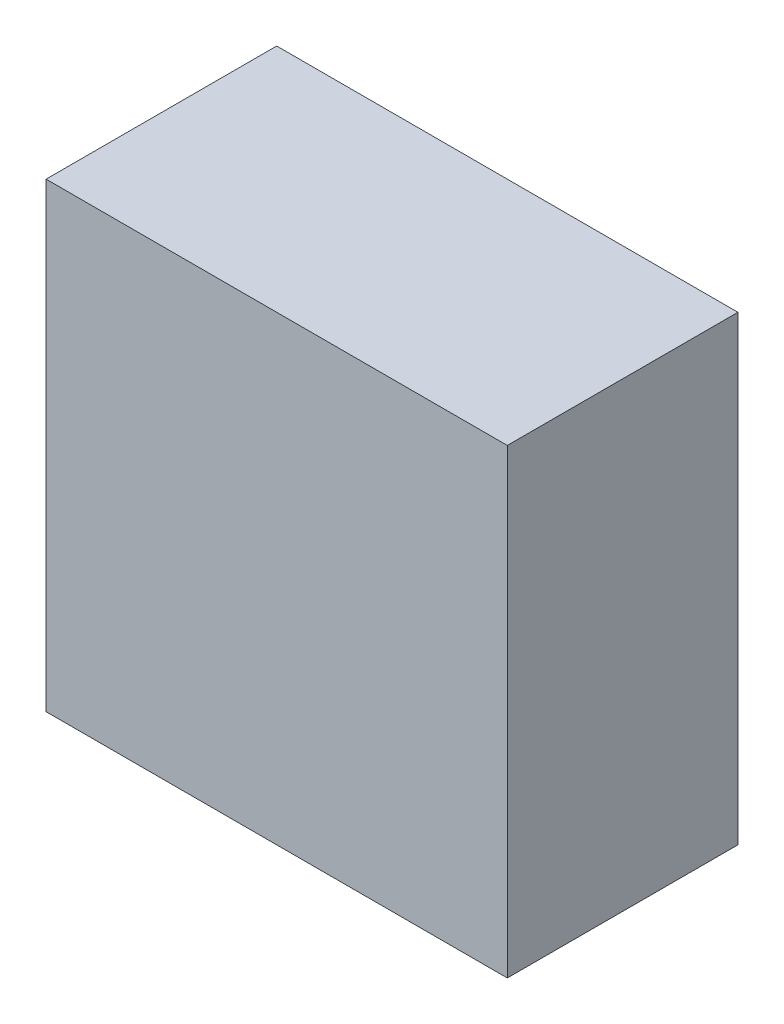
ISO-10303-21;
HEADER;
FILE_DESCRIPTION(('STEP AP214'),'2;1');
FILE_NAME('part.step','',(''),(''),'','','');
FILE_SCHEMA(('AUTOMOTIVE_DESIGN { 1 0 10303 214 1 1 1 1 }'));
ENDSEC;
DATA;
#1=APPLICATION_CONTEXT('core data for automotive mechanical design processes');
#2=APPLICATION_PROTOCOL_DEFINITION('international standard','automotive_design',2000,#1);
#3=PRODUCT_CONTEXT('',#1,'mechanical');
#4=PRODUCT('Part','Part','',(#3));
#5=PRODUCT_RELATED_PRODUCT_CATEGORY('part','',(#4));
#6=PRODUCT_DEFINITION_FORMATION('','',#4);
#7=PRODUCT_DEFINITION_CONTEXT('part definition',#1,'design');
#8=PRODUCT_DEFINITION('design','',#6,#7);
#9=PRODUCT_DEFINITION_SHAPE('','',#8);
#10=(LENGTH_UNIT() NAMED_UNIT(*) SI_UNIT(.MILLI.,.METRE.));
#11=(NAMED_UNIT(*) PLANE_ANGLE_UNIT() SI_UNIT($,.RADIAN.));
#12=(NAMED_UNIT(*) SI_UNIT($,.STERADIAN.) SOLID_ANGLE_UNIT());
#13=UNCERTAINTY_MEASURE_WITH_UNIT(LENGTH_MEASURE(1.E-05),#10,'distance_accuracy_value','');
#14=(GEOMETRIC_REPRESENTATION_CONTEXT(3) GLOBAL_UNCERTAINTY_ASSIGNED_CONTEXT((#13)) GLOBAL_UNIT_ASSIGNED_CONTEXT((#10,
#11,#12)) REPRESENTATION_CONTEXT('',''));
#15=CARTESIAN_POINT('',(0.,0.,0.));
#16=DIRECTION('',(0.,0.,1.));
#17=DIRECTION('',(1.,0.,0.));
#18=AXIS2_PLACEMENT_3D('',#15,#16,#17);
#19=CARTESIAN_POINT('',(0.,0.,2.75));
#20=DIRECTION('',(0.,0.,-1.));
#21=DIRECTION('',(-1.,0.,0.));
#22=AXIS2_PLACEMENT_3D('',#19,#20,#21);
#23=PLANE('',#22);
#24=DIRECTION('',(1.,0.,0.));
#25=VECTOR('',#24,1.);
#26=CARTESIAN_POINT('',(158.313158045853,-7.0708841556957,2.75));
#27=LINE('',#26,#25);
#28=CARTESIAN_POINT('',(158.313158045853,-7.0708841556957,2.75));
#29=VERTEX_POINT('',#28);
#30=CARTESIAN_POINT('',(154.313158045852,-7.0708841556957,2.75));
#31=VERTEX_POINT('',#30);
#32=EDGE_CURVE('E80',#29,#31,#27,.F.);
#33=ORIENTED_EDGE('',*,*,#32,.T.);
#34=DIRECTION('',(0.,1.,0.));
#35=VECTOR('',#34,1.);
#36=CARTESIAN_POINT('',(154.313158045852,-7.0708841556957,2.75));
#37=LINE('',#36,#35);
#38=CARTESIAN_POINT('',(154.313158045852,-11.0708841556957,2.75));
#39=VERTEX_POINT('',#38);
#40=EDGE_CURVE('E55',#31,#39,#37,.F.);
#41=ORIENTED_EDGE('',*,*,#40,.T.);
#42=DIRECTION('',(1.,0.,0.));
#43=VECTOR('',#42,1.);
#44=CARTESIAN_POINT('',(158.313158045853,-11.0708841556957,2.75));
#45=LINE('',#44,#43);
#46=CARTESIAN_POINT('',(158.313158045853,-11.0708841556957,2.75));
#47=VERTEX_POINT('',#46);
#48=EDGE_CURVE('E57',#39,#47,#45,.T.);
#49=ORIENTED_EDGE('',*,*,#48,.T.);
#50=DIRECTION('',(0.,1.,0.));
#51=VECTOR('',#50,1.);
#52=CARTESIAN_POINT('',(158.313158045853,-7.0708841556957,2.75));
#53=LINE('',#52,#51);
#54=EDGE_CURVE('E20',#47,#29,#53,.T.);
#55=ORIENTED_EDGE('',*,*,#54,.T.);
#56=EDGE_LOOP('',(#33,#41,#49,#55));
#57=FACE_BOUND('',#56,.T.);
#58=ADVANCED_FACE('F17',(#57),#23,.F.);
#59=CARTESIAN_POINT('',(158.313158045853,-7.0708841556957,2.75));
#60=DIRECTION('',(-1.,0.,0.));
#61=DIRECTION('',(0.,0.,1.));
#62=AXIS2_PLACEMENT_3D('',#59,#60,#61);
#63=PLANE('',#62);
#64=DIRECTION('',(0.,0.,-1.));
#65=VECTOR('',#64,1.);
#66=CARTESIAN_POINT('',(158.313158045853,-7.0708841556957,2.75));
#67=LINE('',#66,#65);
#68=CARTESIAN_POINT('',(158.313158045853,-7.0708841556957,0.75));
#69=VERTEX_POINT('',#68);
#70=EDGE_CURVE('E68',#69,#29,#67,.F.);
#71=ORIENTED_EDGE('',*,*,#70,.T.);
#72=ORIENTED_EDGE('',*,*,#54,.F.);
#73=DIRECTION('',(0.,0.,1.));
#74=VECTOR('',#73,1.);
#75=CARTESIAN_POINT('',(158.313158045853,-11.0708841556957,2.75));
#76=LINE('',#75,#74);
#77=CARTESIAN_POINT('',(158.313158045853,-11.0708841556957,0.75));
#78=VERTEX_POINT('',#77);
#79=EDGE_CURVE('E63',#47,#78,#76,.F.);
#80=ORIENTED_EDGE('',*,*,#79,.T.);
#81=DIRECTION('',(0.,1.,0.));
#82=VECTOR('',#81,1.);
#83=CARTESIAN_POINT('',(158.313158045853,0.,0.75));
#84=LINE('',#83,#82);
#85=EDGE_CURVE('E83',#69,#78,#84,.F.);
#86=ORIENTED_EDGE('',*,*,#85,.F.);
#87=EDGE_LOOP('',(#71,#72,#80,#86));
#88=FACE_BOUND('',#87,.T.);
#89=ADVANCED_FACE('F65',(#88),#63,.F.);
#90=CARTESIAN_POINT('',(158.313158045853,-11.0708841556957,2.75));
#91=DIRECTION('',(0.,1.,0.));
#92=DIRECTION('',(0.,0.,1.));
#93=AXIS2_PLACEMENT_3D('',#90,#91,#92);
#94=PLANE('',#93);
#95=ORIENTED_EDGE('',*,*,#79,.F.);
#96=ORIENTED_EDGE('',*,*,#48,.F.);
#97=DIRECTION('',(0.,0.,-1.));
#98=VECTOR('',#97,1.);
#99=CARTESIAN_POINT('',(154.313158045852,-11.0708841556957,2.75));
#100=LINE('',#99,#98);
#101=CARTESIAN_POINT('',(154.313158045852,-11.0708841556957,0.75));
#102=VERTEX_POINT('',#101);
#103=EDGE_CURVE('E75',#39,#102,#100,.T.);
#104=ORIENTED_EDGE('',*,*,#103,.T.);
#105=DIRECTION('',(-1.,0.,0.));
#106=VECTOR('',#105,1.);
#107=CARTESIAN_POINT('',(0.,-11.0708841556957,0.75));
#108=LINE('',#107,#106);
#109=EDGE_CURVE('E72',#78,#102,#108,.T.);
#110=ORIENTED_EDGE('',*,*,#109,.F.);
#111=EDGE_LOOP('',(#95,#96,#104,#110));
#112=FACE_BOUND('',#111,.T.);
#113=ADVANCED_FACE('F70',(#112),#94,.F.);
#114=CARTESIAN_POINT('',(154.313158045852,-7.0708841556957,2.75));
#115=DIRECTION('',(1.,0.,0.));
#116=DIRECTION('',(0.,0.,-1.));
#117=AXIS2_PLACEMENT_3D('',#114,#115,#116);
#118=PLANE('',#117);
#119=ORIENTED_EDGE('',*,*,#103,.F.);
#120=ORIENTED_EDGE('',*,*,#40,.F.);
#121=DIRECTION('',(0.,0.,-1.));
#122=VECTOR('',#121,1.);
#123=CARTESIAN_POINT('',(154.313158045852,-7.0708841556957,2.75));
#124=LINE('',#123,#122);
#125=CARTESIAN_POINT('',(154.313158045852,-7.0708841556957,0.75));
#126=VERTEX_POINT('',#125);
#127=EDGE_CURVE('E35',#31,#126,#124,.T.);
#128=ORIENTED_EDGE('',*,*,#127,.T.);
#129=DIRECTION('',(0.,1.,0.));
#130=VECTOR('',#129,1.);
#131=CARTESIAN_POINT('',(154.313158045852,0.,0.75));
#132=LINE('',#131,#130);
#133=EDGE_CURVE('E26',#102,#126,#132,.T.);
#134=ORIENTED_EDGE('',*,*,#133,.F.);
#135=EDGE_LOOP('',(#119,#120,#128,#134));
#136=FACE_BOUND('',#135,.T.);
#137=ADVANCED_FACE('F89',(#136),#118,.F.);
#138=CARTESIAN_POINT('',(158.313158045853,-7.0708841556957,2.75));
#139=DIRECTION('',(0.,-1.,0.));
#140=DIRECTION('',(0.,0.,-1.));
#141=AXIS2_PLACEMENT_3D('',#138,#139,#140);
#142=PLANE('',#141);
#143=ORIENTED_EDGE('',*,*,#127,.F.);
#144=ORIENTED_EDGE('',*,*,#32,.F.);
#145=ORIENTED_EDGE('',*,*,#70,.F.);
#146=DIRECTION('',(-1.,0.,0.));
#147=VECTOR('',#146,1.);
#148=CARTESIAN_POINT('',(0.,-7.0708841556957,0.75));
#149=LINE('',#148,#147);
#150=EDGE_CURVE('E11',#126,#69,#149,.F.);
#151=ORIENTED_EDGE('',*,*,#150,.F.);
#152=EDGE_LOOP('',(#143,#144,#145,#151));
#153=FACE_BOUND('',#152,.T.);
#154=ADVANCED_FACE('F91',(#153),#142,.F.);
#155=CARTESIAN_POINT('',(0.,0.,0.75));
#156=DIRECTION('',(0.,0.,-1.));
#157=DIRECTION('',(-1.,0.,0.));
#158=AXIS2_PLACEMENT_3D('',#155,#156,#157);
#159=PLANE('',#158);
#160=ORIENTED_EDGE('',*,*,#133,.T.);
#161=ORIENTED_EDGE('',*,*,#150,.T.);
#162=ORIENTED_EDGE('',*,*,#85,.T.);
#163=ORIENTED_EDGE('',*,*,#109,.T.);
#164=EDGE_LOOP('',(#160,#161,#162,#163));
#165=FACE_BOUND('',#164,.T.);
#166=ADVANCED_FACE('F88',(#165),#159,.T.);
#167=CLOSED_SHELL('',(#58,#89,#113,#137,#154,#166));
#168=MANIFOLD_SOLID_BREP('B1',#167);
#169=ADVANCED_BREP_SHAPE_REPRESENTATION('',(#18,#168),#14);
#170=SHAPE_DEFINITION_REPRESENTATION(#9,#169);
ENDSEC;
END-ISO-10303-21;
